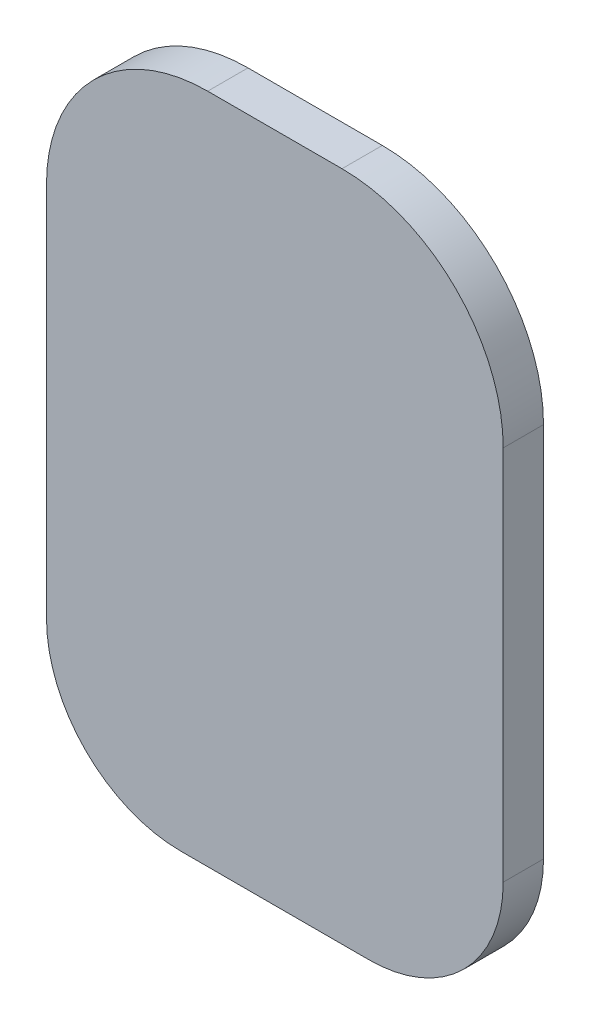
ISO-10303-21;
HEADER;
FILE_DESCRIPTION(('STEP AP214'),'2;1');
FILE_NAME('part.step','',(''),(''),'','','');
FILE_SCHEMA(('AUTOMOTIVE_DESIGN { 1 0 10303 214 1 1 1 1 }'));
ENDSEC;
DATA;
#1=APPLICATION_CONTEXT('core data for automotive mechanical design processes');
#2=APPLICATION_PROTOCOL_DEFINITION('international standard','automotive_design',2000,#1);
#3=PRODUCT_CONTEXT('',#1,'mechanical');
#4=PRODUCT('Part','Part','',(#3));
#5=PRODUCT_RELATED_PRODUCT_CATEGORY('part','',(#4));
#6=PRODUCT_DEFINITION_FORMATION('','',#4);
#7=PRODUCT_DEFINITION_CONTEXT('part definition',#1,'design');
#8=PRODUCT_DEFINITION('design','',#6,#7);
#9=PRODUCT_DEFINITION_SHAPE('','',#8);
#10=(LENGTH_UNIT() NAMED_UNIT(*) SI_UNIT(.MILLI.,.METRE.));
#11=(NAMED_UNIT(*) PLANE_ANGLE_UNIT() SI_UNIT($,.RADIAN.));
#12=(NAMED_UNIT(*) SI_UNIT($,.STERADIAN.) SOLID_ANGLE_UNIT());
#13=UNCERTAINTY_MEASURE_WITH_UNIT(LENGTH_MEASURE(1.E-05),#10,'distance_accuracy_value','');
#14=(GEOMETRIC_REPRESENTATION_CONTEXT(3) GLOBAL_UNCERTAINTY_ASSIGNED_CONTEXT((#13)) GLOBAL_UNIT_ASSIGNED_CONTEXT((#10,
#11,#12)) REPRESENTATION_CONTEXT('',''));
#15=CARTESIAN_POINT('',(0.,0.,0.));
#16=DIRECTION('',(0.,0.,1.));
#17=DIRECTION('',(1.,0.,0.));
#18=AXIS2_PLACEMENT_3D('',#15,#16,#17);
#19=CARTESIAN_POINT('',(-5.,-33.5,3.));
#20=DIRECTION('',(0.,0.,-1.));
#21=DIRECTION('',(-1.,0.,0.));
#22=AXIS2_PLACEMENT_3D('',#19,#20,#21);
#23=CYLINDRICAL_SURFACE('',#22,12.);
#24=CARTESIAN_POINT('',(-5.,-33.5,0.));
#25=DIRECTION('',(0.,0.,1.));
#26=DIRECTION('',(-1.,0.,0.));
#27=AXIS2_PLACEMENT_3D('',#24,#25,#26);
#28=CIRCLE('',#27,12.);
#29=CARTESIAN_POINT('',(-5.,-21.5,0.));
#30=VERTEX_POINT('',#29);
#31=CARTESIAN_POINT('',(-17.,-33.5,0.));
#32=VERTEX_POINT('',#31);
#33=EDGE_CURVE('E133',#30,#32,#28,.T.);
#34=ORIENTED_EDGE('',*,*,#33,.T.);
#35=DIRECTION('',(0.,0.,-1.));
#36=VECTOR('',#35,1.);
#37=CARTESIAN_POINT('',(-17.,-33.5,3.));
#38=LINE('',#37,#36);
#39=CARTESIAN_POINT('',(-17.,-33.5,3.));
#40=VERTEX_POINT('',#39);
#41=EDGE_CURVE('E11',#40,#32,#38,.T.);
#42=ORIENTED_EDGE('',*,*,#41,.F.);
#43=CARTESIAN_POINT('',(-5.,-33.5,3.));
#44=DIRECTION('',(0.,0.,1.));
#45=DIRECTION('',(-1.,0.,0.));
#46=AXIS2_PLACEMENT_3D('',#43,#44,#45);
#47=CIRCLE('',#46,12.);
#48=CARTESIAN_POINT('',(-5.,-21.5,3.));
#49=VERTEX_POINT('',#48);
#50=EDGE_CURVE('E148',#49,#40,#47,.T.);
#51=ORIENTED_EDGE('',*,*,#50,.F.);
#52=DIRECTION('',(0.,0.,-1.));
#53=VECTOR('',#52,1.);
#54=CARTESIAN_POINT('',(-5.,-21.5,3.));
#55=LINE('',#54,#53);
#56=EDGE_CURVE('E129',#49,#30,#55,.T.);
#57=ORIENTED_EDGE('',*,*,#56,.T.);
#58=EDGE_LOOP('',(#34,#42,#51,#57));
#59=FACE_BOUND('',#58,.T.);
#60=ADVANCED_FACE('F37',(#59),#23,.T.);
#61=CARTESIAN_POINT('',(-17.,-33.5,3.));
#62=DIRECTION('',(1.,0.,0.));
#63=DIRECTION('',(0.,1.,0.));
#64=AXIS2_PLACEMENT_3D('',#61,#62,#63);
#65=PLANE('',#64);
#66=DIRECTION('',(0.,-1.,0.));
#67=VECTOR('',#66,1.);
#68=CARTESIAN_POINT('',(-17.,-33.5,0.));
#69=LINE('',#68,#67);
#70=CARTESIAN_POINT('',(-17.,-61.5,0.));
#71=VERTEX_POINT('',#70);
#72=EDGE_CURVE('E136',#32,#71,#69,.T.);
#73=ORIENTED_EDGE('',*,*,#72,.T.);
#74=DIRECTION('',(0.,0.,-1.));
#75=VECTOR('',#74,1.);
#76=CARTESIAN_POINT('',(-17.,-61.5,3.));
#77=LINE('',#76,#75);
#78=CARTESIAN_POINT('',(-17.,-61.5,3.));
#79=VERTEX_POINT('',#78);
#80=EDGE_CURVE('E45',#79,#71,#77,.T.);
#81=ORIENTED_EDGE('',*,*,#80,.F.);
#82=DIRECTION('',(0.,-1.,0.));
#83=VECTOR('',#82,1.);
#84=CARTESIAN_POINT('',(-17.,-33.5,3.));
#85=LINE('',#84,#83);
#86=EDGE_CURVE('E96',#40,#79,#85,.T.);
#87=ORIENTED_EDGE('',*,*,#86,.F.);
#88=ORIENTED_EDGE('',*,*,#41,.T.);
#89=EDGE_LOOP('',(#73,#81,#87,#88));
#90=FACE_BOUND('',#89,.T.);
#91=ADVANCED_FACE('F182',(#90),#65,.F.);
#92=CARTESIAN_POINT('',(-6.99999999999998,-61.5,3.));
#93=DIRECTION('',(0.,0.,-1.));
#94=DIRECTION('',(-1.,0.,0.));
#95=AXIS2_PLACEMENT_3D('',#92,#93,#94);
#96=CYLINDRICAL_SURFACE('',#95,10.);
#97=CARTESIAN_POINT('',(-6.99999999999998,-61.5,0.));
#98=DIRECTION('',(0.,0.,1.));
#99=DIRECTION('',(1.,0.,0.));
#100=AXIS2_PLACEMENT_3D('',#97,#98,#99);
#101=CIRCLE('',#100,10.);
#102=CARTESIAN_POINT('',(-6.99999999999998,-71.5,0.));
#103=VERTEX_POINT('',#102);
#104=EDGE_CURVE('E138',#71,#103,#101,.T.);
#105=ORIENTED_EDGE('',*,*,#104,.T.);
#106=DIRECTION('',(0.,0.,-1.));
#107=VECTOR('',#106,1.);
#108=CARTESIAN_POINT('',(-6.99999999999998,-71.5,3.));
#109=LINE('',#108,#107);
#110=CARTESIAN_POINT('',(-6.99999999999998,-71.5,3.));
#111=VERTEX_POINT('',#110);
#112=EDGE_CURVE('E155',#111,#103,#109,.T.);
#113=ORIENTED_EDGE('',*,*,#112,.F.);
#114=CARTESIAN_POINT('',(-6.99999999999998,-61.5,3.));
#115=DIRECTION('',(0.,0.,1.));
#116=DIRECTION('',(1.,0.,0.));
#117=AXIS2_PLACEMENT_3D('',#114,#115,#116);
#118=CIRCLE('',#117,10.);
#119=EDGE_CURVE('E163',#79,#111,#118,.T.);
#120=ORIENTED_EDGE('',*,*,#119,.F.);
#121=ORIENTED_EDGE('',*,*,#80,.T.);
#122=EDGE_LOOP('',(#105,#113,#120,#121));
#123=FACE_BOUND('',#122,.T.);
#124=ADVANCED_FACE('F161',(#123),#96,.T.);
#125=CARTESIAN_POINT('',(0.500000000000002,-71.5,3.));
#126=DIRECTION('',(0.,1.,0.));
#127=DIRECTION('',(0.,0.,1.));
#128=AXIS2_PLACEMENT_3D('',#125,#126,#127);
#129=PLANE('',#128);
#130=DIRECTION('',(1.,0.,0.));
#131=VECTOR('',#130,1.);
#132=CARTESIAN_POINT('',(0.500000000000002,-71.5,0.));
#133=LINE('',#132,#131);
#134=CARTESIAN_POINT('',(6.99999999999999,-71.5,0.));
#135=VERTEX_POINT('',#134);
#136=EDGE_CURVE('E141',#103,#135,#133,.T.);
#137=ORIENTED_EDGE('',*,*,#136,.T.);
#138=DIRECTION('',(0.,0.,-1.));
#139=VECTOR('',#138,1.);
#140=CARTESIAN_POINT('',(6.99999999999999,-71.5,3.));
#141=LINE('',#140,#139);
#142=CARTESIAN_POINT('',(6.99999999999999,-71.5,3.));
#143=VERTEX_POINT('',#142);
#144=EDGE_CURVE('E152',#143,#135,#141,.T.);
#145=ORIENTED_EDGE('',*,*,#144,.F.);
#146=DIRECTION('',(1.,0.,0.));
#147=VECTOR('',#146,1.);
#148=CARTESIAN_POINT('',(-6.99999999999998,-71.5,3.));
#149=LINE('',#148,#147);
#150=EDGE_CURVE('E174',#111,#143,#149,.T.);
#151=ORIENTED_EDGE('',*,*,#150,.F.);
#152=ORIENTED_EDGE('',*,*,#112,.T.);
#153=EDGE_LOOP('',(#137,#145,#151,#152));
#154=FACE_BOUND('',#153,.T.);
#155=ADVANCED_FACE('F170',(#154),#129,.F.);
#156=CARTESIAN_POINT('',(6.99999999999999,-61.5,3.));
#157=DIRECTION('',(0.,0.,-1.));
#158=DIRECTION('',(-1.,0.,0.));
#159=AXIS2_PLACEMENT_3D('',#156,#157,#158);
#160=CYLINDRICAL_SURFACE('',#159,10.);
#161=CARTESIAN_POINT('',(6.99999999999999,-61.5,0.));
#162=DIRECTION('',(0.,0.,1.));
#163=DIRECTION('',(1.,0.,0.));
#164=AXIS2_PLACEMENT_3D('',#161,#162,#163);
#165=CIRCLE('',#164,10.);
#166=CARTESIAN_POINT('',(17.,-61.5,0.));
#167=VERTEX_POINT('',#166);
#168=EDGE_CURVE('E143',#135,#167,#165,.T.);
#169=ORIENTED_EDGE('',*,*,#168,.T.);
#170=DIRECTION('',(0.,0.,-1.));
#171=VECTOR('',#170,1.);
#172=CARTESIAN_POINT('',(17.,-61.5,3.));
#173=LINE('',#172,#171);
#174=CARTESIAN_POINT('',(17.,-61.5,3.));
#175=VERTEX_POINT('',#174);
#176=EDGE_CURVE('E124',#175,#167,#173,.T.);
#177=ORIENTED_EDGE('',*,*,#176,.F.);
#178=CARTESIAN_POINT('',(6.99999999999999,-61.5,3.));
#179=DIRECTION('',(0.,0.,1.));
#180=DIRECTION('',(1.,0.,0.));
#181=AXIS2_PLACEMENT_3D('',#178,#179,#180);
#182=CIRCLE('',#181,10.);
#183=EDGE_CURVE('E115',#143,#175,#182,.T.);
#184=ORIENTED_EDGE('',*,*,#183,.F.);
#185=ORIENTED_EDGE('',*,*,#144,.T.);
#186=EDGE_LOOP('',(#169,#177,#184,#185));
#187=FACE_BOUND('',#186,.T.);
#188=ADVANCED_FACE('F173',(#187),#160,.T.);
#189=CARTESIAN_POINT('',(17.,-33.5,3.));
#190=DIRECTION('',(-1.,0.,0.));
#191=DIRECTION('',(0.,0.,1.));
#192=AXIS2_PLACEMENT_3D('',#189,#190,#191);
#193=PLANE('',#192);
#194=DIRECTION('',(0.,1.,0.));
#195=VECTOR('',#194,1.);
#196=CARTESIAN_POINT('',(17.,-33.5,0.));
#197=LINE('',#196,#195);
#198=CARTESIAN_POINT('',(17.,-33.5,0.));
#199=VERTEX_POINT('',#198);
#200=EDGE_CURVE('E123',#167,#199,#197,.T.);
#201=ORIENTED_EDGE('',*,*,#200,.T.);
#202=DIRECTION('',(0.,0.,-1.));
#203=VECTOR('',#202,1.);
#204=CARTESIAN_POINT('',(17.,-33.5,3.));
#205=LINE('',#204,#203);
#206=CARTESIAN_POINT('',(17.,-33.5,3.));
#207=VERTEX_POINT('',#206);
#208=EDGE_CURVE('E120',#207,#199,#205,.T.);
#209=ORIENTED_EDGE('',*,*,#208,.F.);
#210=DIRECTION('',(0.,1.,0.));
#211=VECTOR('',#210,1.);
#212=CARTESIAN_POINT('',(17.,-33.5,3.));
#213=LINE('',#212,#211);
#214=EDGE_CURVE('E109',#175,#207,#213,.T.);
#215=ORIENTED_EDGE('',*,*,#214,.F.);
#216=ORIENTED_EDGE('',*,*,#176,.T.);
#217=EDGE_LOOP('',(#201,#209,#215,#216));
#218=FACE_BOUND('',#217,.T.);
#219=ADVANCED_FACE('F121',(#218),#193,.F.);
#220=CARTESIAN_POINT('',(5.,-33.5,3.));
#221=DIRECTION('',(0.,0.,-1.));
#222=DIRECTION('',(-1.,0.,0.));
#223=AXIS2_PLACEMENT_3D('',#220,#221,#222);
#224=CYLINDRICAL_SURFACE('',#223,12.);
#225=CARTESIAN_POINT('',(5.,-33.5,0.));
#226=DIRECTION('',(0.,0.,1.));
#227=DIRECTION('',(-1.,0.,0.));
#228=AXIS2_PLACEMENT_3D('',#225,#226,#227);
#229=CIRCLE('',#228,12.);
#230=CARTESIAN_POINT('',(4.99999999999999,-21.5,0.));
#231=VERTEX_POINT('',#230);
#232=EDGE_CURVE('E82',#199,#231,#229,.T.);
#233=ORIENTED_EDGE('',*,*,#232,.T.);
#234=DIRECTION('',(0.,0.,-1.));
#235=VECTOR('',#234,1.);
#236=CARTESIAN_POINT('',(4.99999999999999,-21.5,3.));
#237=LINE('',#236,#235);
#238=CARTESIAN_POINT('',(4.99999999999999,-21.5,3.));
#239=VERTEX_POINT('',#238);
#240=EDGE_CURVE('E125',#239,#231,#237,.T.);
#241=ORIENTED_EDGE('',*,*,#240,.F.);
#242=CARTESIAN_POINT('',(5.,-33.5,3.));
#243=DIRECTION('',(0.,0.,1.));
#244=DIRECTION('',(-1.,0.,0.));
#245=AXIS2_PLACEMENT_3D('',#242,#243,#244);
#246=CIRCLE('',#245,12.);
#247=EDGE_CURVE('E113',#207,#239,#246,.T.);
#248=ORIENTED_EDGE('',*,*,#247,.F.);
#249=ORIENTED_EDGE('',*,*,#208,.T.);
#250=EDGE_LOOP('',(#233,#241,#248,#249));
#251=FACE_BOUND('',#250,.T.);
#252=ADVANCED_FACE('F127',(#251),#224,.T.);
#253=CARTESIAN_POINT('',(-5.,-21.5,3.));
#254=DIRECTION('',(0.,-1.,0.));
#255=DIRECTION('',(0.,0.,-1.));
#256=AXIS2_PLACEMENT_3D('',#253,#254,#255);
#257=PLANE('',#256);
#258=DIRECTION('',(-1.,0.,0.));
#259=VECTOR('',#258,1.);
#260=CARTESIAN_POINT('',(-5.,-21.5,0.));
#261=LINE('',#260,#259);
#262=EDGE_CURVE('E88',#231,#30,#261,.T.);
#263=ORIENTED_EDGE('',*,*,#262,.T.);
#264=ORIENTED_EDGE('',*,*,#56,.F.);
#265=DIRECTION('',(-1.,0.,0.));
#266=VECTOR('',#265,1.);
#267=CARTESIAN_POINT('',(-5.,-21.5,3.));
#268=LINE('',#267,#266);
#269=EDGE_CURVE('E53',#239,#49,#268,.T.);
#270=ORIENTED_EDGE('',*,*,#269,.F.);
#271=ORIENTED_EDGE('',*,*,#240,.T.);
#272=EDGE_LOOP('',(#263,#264,#270,#271));
#273=FACE_BOUND('',#272,.T.);
#274=ADVANCED_FACE('F198',(#273),#257,.F.);
#275=CARTESIAN_POINT('',(-5.,-33.5,3.));
#276=DIRECTION('',(0.,0.,-1.));
#277=DIRECTION('',(-1.,0.,0.));
#278=AXIS2_PLACEMENT_3D('',#275,#276,#277);
#279=PLANE('',#278);
#280=ORIENTED_EDGE('',*,*,#50,.T.);
#281=ORIENTED_EDGE('',*,*,#86,.T.);
#282=ORIENTED_EDGE('',*,*,#119,.T.);
#283=ORIENTED_EDGE('',*,*,#150,.T.);
#284=ORIENTED_EDGE('',*,*,#183,.T.);
#285=ORIENTED_EDGE('',*,*,#214,.T.);
#286=ORIENTED_EDGE('',*,*,#247,.T.);
#287=ORIENTED_EDGE('',*,*,#269,.T.);
#288=EDGE_LOOP('',(#280,#281,#282,#283,#284,#285,#286,#287));
#289=FACE_BOUND('',#288,.T.);
#290=ADVANCED_FACE('F111',(#289),#279,.F.);
#291=CARTESIAN_POINT('',(-5.,-33.5,0.));
#292=DIRECTION('',(0.,0.,-1.));
#293=DIRECTION('',(-1.,0.,0.));
#294=AXIS2_PLACEMENT_3D('',#291,#292,#293);
#295=PLANE('',#294);
#296=ORIENTED_EDGE('',*,*,#33,.F.);
#297=ORIENTED_EDGE('',*,*,#262,.F.);
#298=ORIENTED_EDGE('',*,*,#232,.F.);
#299=ORIENTED_EDGE('',*,*,#200,.F.);
#300=ORIENTED_EDGE('',*,*,#168,.F.);
#301=ORIENTED_EDGE('',*,*,#136,.F.);
#302=ORIENTED_EDGE('',*,*,#104,.F.);
#303=ORIENTED_EDGE('',*,*,#72,.F.);
#304=EDGE_LOOP('',(#296,#297,#298,#299,#300,#301,#302,#303));
#305=FACE_BOUND('',#304,.T.);
#306=ADVANCED_FACE('F166',(#305),#295,.T.);
#307=CLOSED_SHELL('',(#60,#91,#124,#155,#188,#219,#252,#274,#290,#306));
#308=MANIFOLD_SOLID_BREP('B2',#307);
#309=ADVANCED_BREP_SHAPE_REPRESENTATION('',(#18,#308),#14);
#310=SHAPE_DEFINITION_REPRESENTATION(#9,#309);
ENDSEC;
END-ISO-10303-21;
